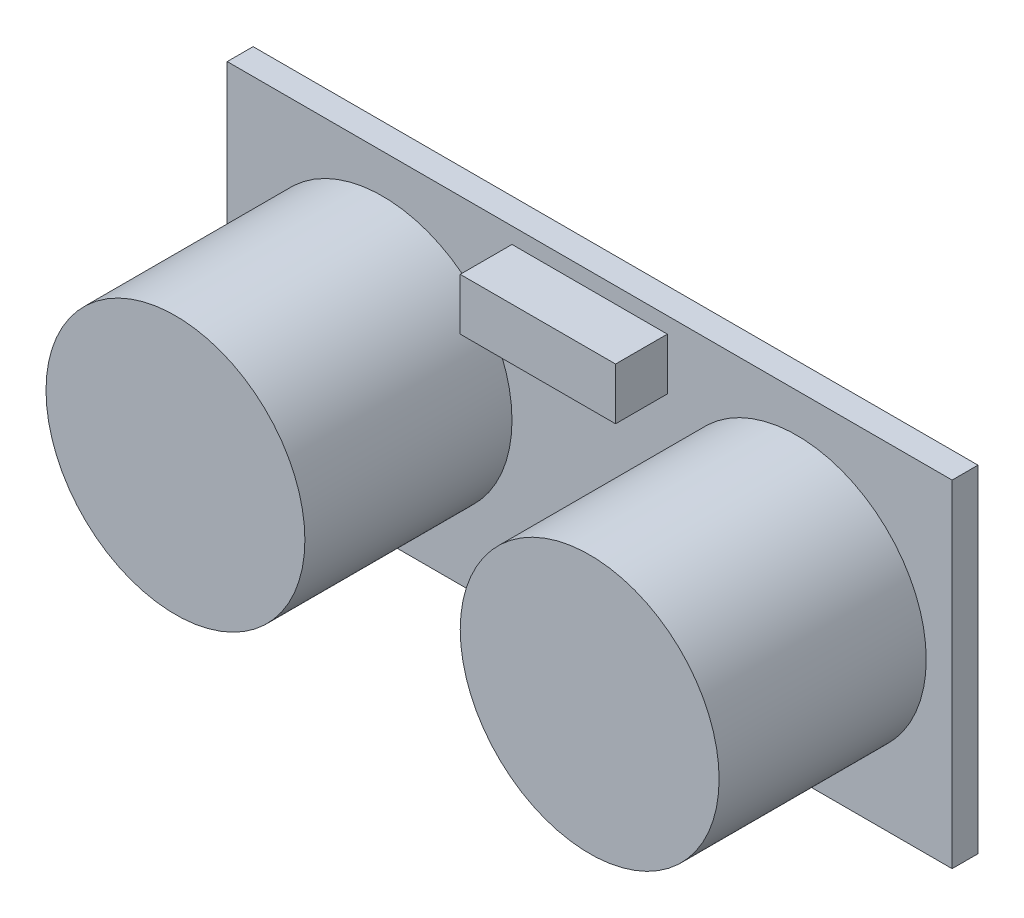
ISO-10303-21;
HEADER;
FILE_DESCRIPTION(('STEP AP214'),'2;1');
FILE_NAME('part.step','',(''),(''),'','','');
FILE_SCHEMA(('AUTOMOTIVE_DESIGN { 1 0 10303 214 1 1 1 1 }'));
ENDSEC;
DATA;
#1=APPLICATION_CONTEXT('core data for automotive mechanical design processes');
#2=APPLICATION_PROTOCOL_DEFINITION('international standard','automotive_design',2000,#1);
#3=PRODUCT_CONTEXT('',#1,'mechanical');
#4=PRODUCT('Part','Part','',(#3));
#5=PRODUCT_RELATED_PRODUCT_CATEGORY('part','',(#4));
#6=PRODUCT_DEFINITION_FORMATION('','',#4);
#7=PRODUCT_DEFINITION_CONTEXT('part definition',#1,'design');
#8=PRODUCT_DEFINITION('design','',#6,#7);
#9=PRODUCT_DEFINITION_SHAPE('','',#8);
#10=(LENGTH_UNIT() NAMED_UNIT(*) SI_UNIT(.MILLI.,.METRE.));
#11=(NAMED_UNIT(*) PLANE_ANGLE_UNIT() SI_UNIT($,.RADIAN.));
#12=(NAMED_UNIT(*) SI_UNIT($,.STERADIAN.) SOLID_ANGLE_UNIT());
#13=UNCERTAINTY_MEASURE_WITH_UNIT(LENGTH_MEASURE(1.E-05),#10,'distance_accuracy_value','');
#14=(GEOMETRIC_REPRESENTATION_CONTEXT(3) GLOBAL_UNCERTAINTY_ASSIGNED_CONTEXT((#13)) GLOBAL_UNIT_ASSIGNED_CONTEXT((#10,
#11,#12)) REPRESENTATION_CONTEXT('',''));
#15=CARTESIAN_POINT('',(0.,0.,0.));
#16=DIRECTION('',(0.,0.,1.));
#17=DIRECTION('',(1.,0.,0.));
#18=AXIS2_PLACEMENT_3D('',#15,#16,#17);
#19=CARTESIAN_POINT('',(22.225,10.31875,1.5875));
#20=DIRECTION('',(0.,0.,-1.));
#21=DIRECTION('',(-1.,0.,0.));
#22=AXIS2_PLACEMENT_3D('',#19,#20,#21);
#23=PLANE('',#22);
#24=CARTESIAN_POINT('',(-12.7,0.,1.5875));
#25=DIRECTION('',(0.,0.,-1.));
#26=DIRECTION('',(-1.,0.,0.));
#27=AXIS2_PLACEMENT_3D('',#24,#25,#26);
#28=CIRCLE('',#27,7.9375);
#29=CARTESIAN_POINT('',(-20.6375,0.,1.5875));
#30=VERTEX_POINT('',#29);
#31=EDGE_CURVE('E11',#30,#30,#28,.F.);
#32=ORIENTED_EDGE('',*,*,#31,.F.);
#33=EDGE_LOOP('',(#32));
#34=FACE_BOUND('',#33,.T.);
#35=DIRECTION('',(0.,1.,0.));
#36=VECTOR('',#35,1.);
#37=CARTESIAN_POINT('',(22.225,-10.31875,1.5875));
#38=LINE('',#37,#36);
#39=CARTESIAN_POINT('',(22.225,-10.31875,1.5875));
#40=VERTEX_POINT('',#39);
#41=CARTESIAN_POINT('',(22.225,10.31875,1.5875));
#42=VERTEX_POINT('',#41);
#43=EDGE_CURVE('E136',#40,#42,#38,.T.);
#44=ORIENTED_EDGE('',*,*,#43,.T.);
#45=DIRECTION('',(-1.,0.,0.));
#46=VECTOR('',#45,1.);
#47=CARTESIAN_POINT('',(-22.225,10.31875,1.5875));
#48=LINE('',#47,#46);
#49=CARTESIAN_POINT('',(-22.225,10.31875,1.5875));
#50=VERTEX_POINT('',#49);
#51=EDGE_CURVE('E139',#42,#50,#48,.T.);
#52=ORIENTED_EDGE('',*,*,#51,.T.);
#53=DIRECTION('',(0.,-1.,0.));
#54=VECTOR('',#53,1.);
#55=CARTESIAN_POINT('',(-22.225,-10.31875,1.5875));
#56=LINE('',#55,#54);
#57=CARTESIAN_POINT('',(-22.225,-10.31875,1.5875));
#58=VERTEX_POINT('',#57);
#59=EDGE_CURVE('E142',#50,#58,#56,.T.);
#60=ORIENTED_EDGE('',*,*,#59,.T.);
#61=DIRECTION('',(1.,0.,0.));
#62=VECTOR('',#61,1.);
#63=CARTESIAN_POINT('',(-22.225,-10.31875,1.5875));
#64=LINE('',#63,#62);
#65=EDGE_CURVE('E144',#58,#40,#64,.T.);
#66=ORIENTED_EDGE('',*,*,#65,.T.);
#67=EDGE_LOOP('',(#44,#52,#60,#66));
#68=FACE_BOUND('',#67,.T.);
#69=CARTESIAN_POINT('',(12.7,0.,1.5875));
#70=DIRECTION('',(0.,0.,-1.));
#71=DIRECTION('',(-1.,0.,0.));
#72=AXIS2_PLACEMENT_3D('',#69,#70,#71);
#73=CIRCLE('',#72,7.9375);
#74=CARTESIAN_POINT('',(4.7625,0.,1.5875));
#75=VERTEX_POINT('',#74);
#76=EDGE_CURVE('E121',#75,#75,#73,.T.);
#77=ORIENTED_EDGE('',*,*,#76,.T.);
#78=EDGE_LOOP('',(#77));
#79=FACE_BOUND('',#78,.T.);
#80=DIRECTION('',(0.,1.,0.));
#81=VECTOR('',#80,1.);
#82=CARTESIAN_POINT('',(4.76250000000001,6.1629310810913,1.5875));
#83=LINE('',#82,#81);
#84=CARTESIAN_POINT('',(4.76250000000001,6.1629310810913,1.5875));
#85=VERTEX_POINT('',#84);
#86=CARTESIAN_POINT('',(4.76250000000001,9.3379310810913,1.5875));
#87=VERTEX_POINT('',#86);
#88=EDGE_CURVE('E120',#85,#87,#83,.T.);
#89=ORIENTED_EDGE('',*,*,#88,.F.);
#90=DIRECTION('',(1.,0.,0.));
#91=VECTOR('',#90,1.);
#92=CARTESIAN_POINT('',(-4.76249999999999,6.1629310810913,1.5875));
#93=LINE('',#92,#91);
#94=CARTESIAN_POINT('',(-4.76249999999999,6.1629310810913,1.5875));
#95=VERTEX_POINT('',#94);
#96=EDGE_CURVE('E117',#95,#85,#93,.T.);
#97=ORIENTED_EDGE('',*,*,#96,.F.);
#98=DIRECTION('',(0.,-1.,0.));
#99=VECTOR('',#98,1.);
#100=CARTESIAN_POINT('',(-4.76249999999999,6.1629310810913,1.5875));
#101=LINE('',#100,#99);
#102=CARTESIAN_POINT('',(-4.76249999999999,9.3379310810913,1.5875));
#103=VERTEX_POINT('',#102);
#104=EDGE_CURVE('E55',#103,#95,#101,.T.);
#105=ORIENTED_EDGE('',*,*,#104,.F.);
#106=DIRECTION('',(-1.,0.,0.));
#107=VECTOR('',#106,1.);
#108=CARTESIAN_POINT('',(-4.76249999999999,9.3379310810913,1.5875));
#109=LINE('',#108,#107);
#110=EDGE_CURVE('E50',#87,#103,#109,.T.);
#111=ORIENTED_EDGE('',*,*,#110,.F.);
#112=EDGE_LOOP('',(#89,#97,#105,#111));
#113=FACE_BOUND('',#112,.T.);
#114=ADVANCED_FACE('F35',(#34,#68,#79,#113),#23,.F.);
#115=CARTESIAN_POINT('',(22.225,-10.31875,1.5875));
#116=DIRECTION('',(-1.,0.,0.));
#117=DIRECTION('',(0.,0.,1.));
#118=AXIS2_PLACEMENT_3D('',#115,#116,#117);
#119=PLANE('',#118);
#120=DIRECTION('',(0.,1.,0.));
#121=VECTOR('',#120,1.);
#122=CARTESIAN_POINT('',(22.225,-10.31875,0.));
#123=LINE('',#122,#121);
#124=CARTESIAN_POINT('',(22.225,-10.31875,0.));
#125=VERTEX_POINT('',#124);
#126=CARTESIAN_POINT('',(22.225,10.31875,0.));
#127=VERTEX_POINT('',#126);
#128=EDGE_CURVE('E135',#125,#127,#123,.T.);
#129=ORIENTED_EDGE('',*,*,#128,.T.);
#130=DIRECTION('',(0.,0.,-1.));
#131=VECTOR('',#130,1.);
#132=CARTESIAN_POINT('',(22.225,10.31875,1.5875));
#133=LINE('',#132,#131);
#134=EDGE_CURVE('E43',#42,#127,#133,.T.);
#135=ORIENTED_EDGE('',*,*,#134,.F.);
#136=ORIENTED_EDGE('',*,*,#43,.F.);
#137=DIRECTION('',(0.,0.,-1.));
#138=VECTOR('',#137,1.);
#139=CARTESIAN_POINT('',(22.225,-10.31875,1.5875));
#140=LINE('',#139,#138);
#141=EDGE_CURVE('E146',#40,#125,#140,.T.);
#142=ORIENTED_EDGE('',*,*,#141,.T.);
#143=EDGE_LOOP('',(#129,#135,#136,#142));
#144=FACE_BOUND('',#143,.T.);
#145=ADVANCED_FACE('F37',(#144),#119,.F.);
#146=CARTESIAN_POINT('',(-22.225,10.31875,1.5875));
#147=DIRECTION('',(0.,-1.,0.));
#148=DIRECTION('',(0.,0.,-1.));
#149=AXIS2_PLACEMENT_3D('',#146,#147,#148);
#150=PLANE('',#149);
#151=DIRECTION('',(-1.,0.,0.));
#152=VECTOR('',#151,1.);
#153=CARTESIAN_POINT('',(-22.225,10.31875,0.));
#154=LINE('',#153,#152);
#155=CARTESIAN_POINT('',(-22.225,10.31875,0.));
#156=VERTEX_POINT('',#155);
#157=EDGE_CURVE('E149',#127,#156,#154,.T.);
#158=ORIENTED_EDGE('',*,*,#157,.T.);
#159=DIRECTION('',(0.,0.,-1.));
#160=VECTOR('',#159,1.);
#161=CARTESIAN_POINT('',(-22.225,10.31875,1.5875));
#162=LINE('',#161,#160);
#163=EDGE_CURVE('E159',#50,#156,#162,.T.);
#164=ORIENTED_EDGE('',*,*,#163,.F.);
#165=ORIENTED_EDGE('',*,*,#51,.F.);
#166=ORIENTED_EDGE('',*,*,#134,.T.);
#167=EDGE_LOOP('',(#158,#164,#165,#166));
#168=FACE_BOUND('',#167,.T.);
#169=ADVANCED_FACE('F164',(#168),#150,.F.);
#170=CARTESIAN_POINT('',(-22.225,-10.31875,1.5875));
#171=DIRECTION('',(1.,0.,0.));
#172=DIRECTION('',(0.,0.,-1.));
#173=AXIS2_PLACEMENT_3D('',#170,#171,#172);
#174=PLANE('',#173);
#175=DIRECTION('',(0.,-1.,0.));
#176=VECTOR('',#175,1.);
#177=CARTESIAN_POINT('',(-22.225,-10.31875,0.));
#178=LINE('',#177,#176);
#179=CARTESIAN_POINT('',(-22.225,-10.31875,0.));
#180=VERTEX_POINT('',#179);
#181=EDGE_CURVE('E151',#156,#180,#178,.T.);
#182=ORIENTED_EDGE('',*,*,#181,.T.);
#183=DIRECTION('',(0.,0.,-1.));
#184=VECTOR('',#183,1.);
#185=CARTESIAN_POINT('',(-22.225,-10.31875,1.5875));
#186=LINE('',#185,#184);
#187=EDGE_CURVE('E156',#58,#180,#186,.T.);
#188=ORIENTED_EDGE('',*,*,#187,.F.);
#189=ORIENTED_EDGE('',*,*,#59,.F.);
#190=ORIENTED_EDGE('',*,*,#163,.T.);
#191=EDGE_LOOP('',(#182,#188,#189,#190));
#192=FACE_BOUND('',#191,.T.);
#193=ADVANCED_FACE('F176',(#192),#174,.F.);
#194=CARTESIAN_POINT('',(-22.225,-10.31875,1.5875));
#195=DIRECTION('',(0.,1.,0.));
#196=DIRECTION('',(0.,0.,1.));
#197=AXIS2_PLACEMENT_3D('',#194,#195,#196);
#198=PLANE('',#197);
#199=DIRECTION('',(1.,0.,0.));
#200=VECTOR('',#199,1.);
#201=CARTESIAN_POINT('',(-22.225,-10.31875,0.));
#202=LINE('',#201,#200);
#203=EDGE_CURVE('E140',#180,#125,#202,.T.);
#204=ORIENTED_EDGE('',*,*,#203,.T.);
#205=ORIENTED_EDGE('',*,*,#141,.F.);
#206=ORIENTED_EDGE('',*,*,#65,.F.);
#207=ORIENTED_EDGE('',*,*,#187,.T.);
#208=EDGE_LOOP('',(#204,#205,#206,#207));
#209=FACE_BOUND('',#208,.T.);
#210=ADVANCED_FACE('F180',(#209),#198,.F.);
#211=CARTESIAN_POINT('',(22.225,10.31875,0.));
#212=DIRECTION('',(0.,0.,-1.));
#213=DIRECTION('',(-1.,0.,0.));
#214=AXIS2_PLACEMENT_3D('',#211,#212,#213);
#215=PLANE('',#214);
#216=ORIENTED_EDGE('',*,*,#128,.F.);
#217=ORIENTED_EDGE('',*,*,#203,.F.);
#218=ORIENTED_EDGE('',*,*,#181,.F.);
#219=ORIENTED_EDGE('',*,*,#157,.F.);
#220=EDGE_LOOP('',(#216,#217,#218,#219));
#221=FACE_BOUND('',#220,.T.);
#222=ADVANCED_FACE('F172',(#221),#215,.T.);
#223=CARTESIAN_POINT('',(-12.7,0.,14.2875));
#224=DIRECTION('',(0.,0.,-1.));
#225=DIRECTION('',(-1.,0.,0.));
#226=AXIS2_PLACEMENT_3D('',#223,#224,#225);
#227=CYLINDRICAL_SURFACE('',#226,7.9375);
#228=CARTESIAN_POINT('',(-12.7,0.,14.2875));
#229=DIRECTION('',(0.,0.,1.));
#230=DIRECTION('',(1.,0.,0.));
#231=AXIS2_PLACEMENT_3D('',#228,#229,#230);
#232=CIRCLE('',#231,7.9375);
#233=CARTESIAN_POINT('',(-4.7625,0.,14.2875));
#234=VERTEX_POINT('',#233);
#235=EDGE_CURVE('E131',#234,#234,#232,.T.);
#236=ORIENTED_EDGE('',*,*,#235,.F.);
#237=EDGE_LOOP('',(#236));
#238=FACE_BOUND('',#237,.T.);
#239=ORIENTED_EDGE('',*,*,#31,.T.);
#240=EDGE_LOOP('',(#239));
#241=FACE_BOUND('',#240,.T.);
#242=ADVANCED_FACE('F225',(#238,#241),#227,.T.);
#243=CARTESIAN_POINT('',(-12.7,0.,14.2875));
#244=DIRECTION('',(0.,0.,1.));
#245=DIRECTION('',(1.,0.,0.));
#246=AXIS2_PLACEMENT_3D('',#243,#244,#245);
#247=PLANE('',#246);
#248=ORIENTED_EDGE('',*,*,#235,.T.);
#249=EDGE_LOOP('',(#248));
#250=FACE_BOUND('',#249,.T.);
#251=ADVANCED_FACE('F221',(#250),#247,.T.);
#252=CARTESIAN_POINT('',(12.7,0.,14.2875));
#253=DIRECTION('',(0.,0.,-1.));
#254=DIRECTION('',(-1.,0.,0.));
#255=AXIS2_PLACEMENT_3D('',#252,#253,#254);
#256=CYLINDRICAL_SURFACE('',#255,7.9375);
#257=CARTESIAN_POINT('',(12.7,0.,14.2875));
#258=DIRECTION('',(0.,0.,-1.));
#259=DIRECTION('',(-1.,0.,0.));
#260=AXIS2_PLACEMENT_3D('',#257,#258,#259);
#261=CIRCLE('',#260,7.9375);
#262=CARTESIAN_POINT('',(4.7625,0.,14.2875));
#263=VERTEX_POINT('',#262);
#264=EDGE_CURVE('E124',#263,#263,#261,.T.);
#265=ORIENTED_EDGE('',*,*,#264,.T.);
#266=EDGE_LOOP('',(#265));
#267=FACE_BOUND('',#266,.T.);
#268=ORIENTED_EDGE('',*,*,#76,.F.);
#269=EDGE_LOOP('',(#268));
#270=FACE_BOUND('',#269,.T.);
#271=ADVANCED_FACE('F217',(#267,#270),#256,.T.);
#272=CARTESIAN_POINT('',(12.7,0.,14.2875));
#273=DIRECTION('',(0.,0.,1.));
#274=DIRECTION('',(-1.,0.,0.));
#275=AXIS2_PLACEMENT_3D('',#272,#273,#274);
#276=PLANE('',#275);
#277=ORIENTED_EDGE('',*,*,#264,.F.);
#278=EDGE_LOOP('',(#277));
#279=FACE_BOUND('',#278,.T.);
#280=ADVANCED_FACE('F214',(#279),#276,.T.);
#281=CARTESIAN_POINT('',(4.76250000000001,6.1629310810913,4.7625));
#282=DIRECTION('',(-1.,0.,0.));
#283=DIRECTION('',(0.,0.,1.));
#284=AXIS2_PLACEMENT_3D('',#281,#282,#283);
#285=PLANE('',#284);
#286=ORIENTED_EDGE('',*,*,#88,.T.);
#287=DIRECTION('',(0.,0.,-1.));
#288=VECTOR('',#287,1.);
#289=CARTESIAN_POINT('',(4.76250000000001,9.3379310810913,4.7625));
#290=LINE('',#289,#288);
#291=CARTESIAN_POINT('',(4.76250000000001,9.3379310810913,4.7625));
#292=VERTEX_POINT('',#291);
#293=EDGE_CURVE('E101',#292,#87,#290,.T.);
#294=ORIENTED_EDGE('',*,*,#293,.F.);
#295=DIRECTION('',(0.,1.,0.));
#296=VECTOR('',#295,1.);
#297=CARTESIAN_POINT('',(4.76250000000001,6.1629310810913,4.7625));
#298=LINE('',#297,#296);
#299=CARTESIAN_POINT('',(4.76250000000001,6.1629310810913,4.7625));
#300=VERTEX_POINT('',#299);
#301=EDGE_CURVE('E108',#300,#292,#298,.T.);
#302=ORIENTED_EDGE('',*,*,#301,.F.);
#303=DIRECTION('',(0.,0.,-1.));
#304=VECTOR('',#303,1.);
#305=CARTESIAN_POINT('',(4.76250000000001,6.1629310810913,4.7625));
#306=LINE('',#305,#304);
#307=EDGE_CURVE('E192',#300,#85,#306,.T.);
#308=ORIENTED_EDGE('',*,*,#307,.T.);
#309=EDGE_LOOP('',(#286,#294,#302,#308));
#310=FACE_BOUND('',#309,.T.);
#311=ADVANCED_FACE('F119',(#310),#285,.F.);
#312=CARTESIAN_POINT('',(-4.76249999999999,9.3379310810913,4.7625));
#313=DIRECTION('',(0.,-1.,0.));
#314=DIRECTION('',(0.,0.,-1.));
#315=AXIS2_PLACEMENT_3D('',#312,#313,#314);
#316=PLANE('',#315);
#317=ORIENTED_EDGE('',*,*,#110,.T.);
#318=DIRECTION('',(0.,0.,-1.));
#319=VECTOR('',#318,1.);
#320=CARTESIAN_POINT('',(-4.76249999999999,9.3379310810913,4.7625));
#321=LINE('',#320,#319);
#322=CARTESIAN_POINT('',(-4.76249999999999,9.3379310810913,4.7625));
#323=VERTEX_POINT('',#322);
#324=EDGE_CURVE('E104',#323,#103,#321,.T.);
#325=ORIENTED_EDGE('',*,*,#324,.F.);
#326=DIRECTION('',(-1.,0.,0.));
#327=VECTOR('',#326,1.);
#328=CARTESIAN_POINT('',(-4.76249999999999,9.3379310810913,4.7625));
#329=LINE('',#328,#327);
#330=EDGE_CURVE('E97',#292,#323,#329,.T.);
#331=ORIENTED_EDGE('',*,*,#330,.F.);
#332=ORIENTED_EDGE('',*,*,#293,.T.);
#333=EDGE_LOOP('',(#317,#325,#331,#332));
#334=FACE_BOUND('',#333,.T.);
#335=ADVANCED_FACE('F99',(#334),#316,.F.);
#336=CARTESIAN_POINT('',(-4.76249999999999,6.1629310810913,4.7625));
#337=DIRECTION('',(1.,0.,0.));
#338=DIRECTION('',(0.,0.,-1.));
#339=AXIS2_PLACEMENT_3D('',#336,#337,#338);
#340=PLANE('',#339);
#341=ORIENTED_EDGE('',*,*,#104,.T.);
#342=DIRECTION('',(0.,0.,-1.));
#343=VECTOR('',#342,1.);
#344=CARTESIAN_POINT('',(-4.76249999999999,6.1629310810913,4.7625));
#345=LINE('',#344,#343);
#346=CARTESIAN_POINT('',(-4.76249999999999,6.1629310810913,4.7625));
#347=VERTEX_POINT('',#346);
#348=EDGE_CURVE('E126',#347,#95,#345,.T.);
#349=ORIENTED_EDGE('',*,*,#348,.F.);
#350=DIRECTION('',(0.,-1.,0.));
#351=VECTOR('',#350,1.);
#352=CARTESIAN_POINT('',(-4.76249999999999,6.1629310810913,4.7625));
#353=LINE('',#352,#351);
#354=EDGE_CURVE('E107',#323,#347,#353,.T.);
#355=ORIENTED_EDGE('',*,*,#354,.F.);
#356=ORIENTED_EDGE('',*,*,#324,.T.);
#357=EDGE_LOOP('',(#341,#349,#355,#356));
#358=FACE_BOUND('',#357,.T.);
#359=ADVANCED_FACE('F201',(#358),#340,.F.);
#360=CARTESIAN_POINT('',(-4.76249999999999,6.1629310810913,4.7625));
#361=DIRECTION('',(0.,1.,0.));
#362=DIRECTION('',(-1.,0.,0.));
#363=AXIS2_PLACEMENT_3D('',#360,#361,#362);
#364=PLANE('',#363);
#365=ORIENTED_EDGE('',*,*,#96,.T.);
#366=ORIENTED_EDGE('',*,*,#307,.F.);
#367=DIRECTION('',(1.,0.,0.));
#368=VECTOR('',#367,1.);
#369=CARTESIAN_POINT('',(-4.76249999999999,6.1629310810913,4.7625));
#370=LINE('',#369,#368);
#371=EDGE_CURVE('E113',#347,#300,#370,.T.);
#372=ORIENTED_EDGE('',*,*,#371,.F.);
#373=ORIENTED_EDGE('',*,*,#348,.T.);
#374=EDGE_LOOP('',(#365,#366,#372,#373));
#375=FACE_BOUND('',#374,.T.);
#376=ADVANCED_FACE('F191',(#375),#364,.F.);
#377=CARTESIAN_POINT('',(4.76250000000001,9.3379310810913,4.7625));
#378=DIRECTION('',(0.,0.,-1.));
#379=DIRECTION('',(-1.,0.,0.));
#380=AXIS2_PLACEMENT_3D('',#377,#378,#379);
#381=PLANE('',#380);
#382=ORIENTED_EDGE('',*,*,#301,.T.);
#383=ORIENTED_EDGE('',*,*,#330,.T.);
#384=ORIENTED_EDGE('',*,*,#354,.T.);
#385=ORIENTED_EDGE('',*,*,#371,.T.);
#386=EDGE_LOOP('',(#382,#383,#384,#385));
#387=FACE_BOUND('',#386,.T.);
#388=ADVANCED_FACE('F111',(#387),#381,.F.);
#389=CLOSED_SHELL('',(#114,#145,#169,#193,#210,#222,#242,#251,#271,#280,#311,#335,#359,#376,#388));
#390=MANIFOLD_SOLID_BREP('B2',#389);
#391=ADVANCED_BREP_SHAPE_REPRESENTATION('',(#18,#390),#14);
#392=SHAPE_DEFINITION_REPRESENTATION(#9,#391);
ENDSEC;
END-ISO-10303-21;
